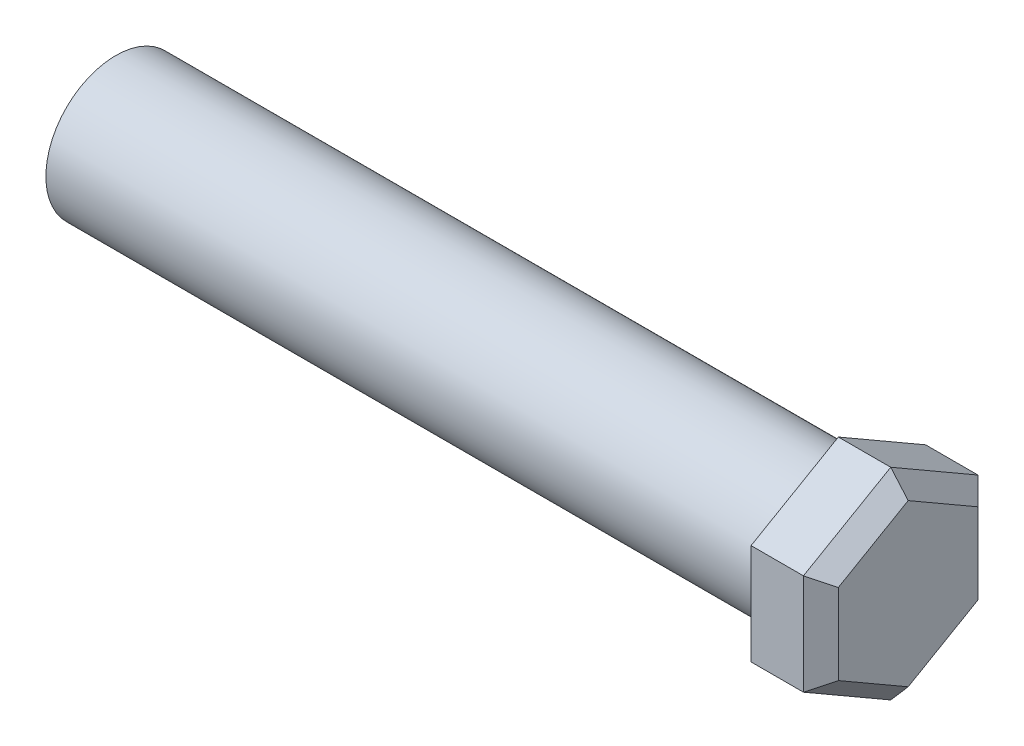
ISO-10303-21;
HEADER;
FILE_DESCRIPTION(('STEP AP214'),'2;1');
FILE_NAME('part.step','',(''),(''),'','','');
FILE_SCHEMA(('AUTOMOTIVE_DESIGN { 1 0 10303 214 1 1 1 1 }'));
ENDSEC;
DATA;
#1=APPLICATION_CONTEXT('core data for automotive mechanical design processes');
#2=APPLICATION_PROTOCOL_DEFINITION('international standard','automotive_design',2000,#1);
#3=PRODUCT_CONTEXT('',#1,'mechanical');
#4=PRODUCT('Part','Part','',(#3));
#5=PRODUCT_RELATED_PRODUCT_CATEGORY('part','',(#4));
#6=PRODUCT_DEFINITION_FORMATION('','',#4);
#7=PRODUCT_DEFINITION_CONTEXT('part definition',#1,'design');
#8=PRODUCT_DEFINITION('design','',#6,#7);
#9=PRODUCT_DEFINITION_SHAPE('','',#8);
#10=(LENGTH_UNIT() NAMED_UNIT(*) SI_UNIT(.MILLI.,.METRE.));
#11=(NAMED_UNIT(*) PLANE_ANGLE_UNIT() SI_UNIT($,.RADIAN.));
#12=(NAMED_UNIT(*) SI_UNIT($,.STERADIAN.) SOLID_ANGLE_UNIT());
#13=UNCERTAINTY_MEASURE_WITH_UNIT(LENGTH_MEASURE(1.E-05),#10,'distance_accuracy_value','');
#14=(GEOMETRIC_REPRESENTATION_CONTEXT(3) GLOBAL_UNCERTAINTY_ASSIGNED_CONTEXT((#13)) GLOBAL_UNIT_ASSIGNED_CONTEXT((#10,
#11,#12)) REPRESENTATION_CONTEXT('',''));
#15=CARTESIAN_POINT('',(0.,0.,0.));
#16=DIRECTION('',(0.,0.,1.));
#17=DIRECTION('',(1.,0.,0.));
#18=AXIS2_PLACEMENT_3D('',#15,#16,#17);
#19=CARTESIAN_POINT('',(20.7,0.,0.));
#20=DIRECTION('',(-1.,0.,0.));
#21=DIRECTION('',(0.,0.,1.));
#22=AXIS2_PLACEMENT_3D('',#19,#20,#21);
#23=CYLINDRICAL_SURFACE('',#22,2.);
#24=CARTESIAN_POINT('',(20.7,0.,0.));
#25=DIRECTION('',(1.,0.,0.));
#26=DIRECTION('',(0.,0.,-1.));
#27=AXIS2_PLACEMENT_3D('',#24,#25,#26);
#28=CIRCLE('',#27,2.);
#29=CARTESIAN_POINT('',(20.7,0.,-2.));
#30=VERTEX_POINT('',#29);
#31=EDGE_CURVE('E175',#30,#30,#28,.T.);
#32=ORIENTED_EDGE('',*,*,#31,.F.);
#33=EDGE_LOOP('',(#32));
#34=FACE_BOUND('',#33,.T.);
#35=CARTESIAN_POINT('',(0.,0.,0.));
#36=DIRECTION('',(1.,0.,0.));
#37=DIRECTION('',(0.,0.,-1.));
#38=AXIS2_PLACEMENT_3D('',#35,#36,#37);
#39=CIRCLE('',#38,2.);
#40=CARTESIAN_POINT('',(0.,0.,-2.));
#41=VERTEX_POINT('',#40);
#42=EDGE_CURVE('E126',#41,#41,#39,.T.);
#43=ORIENTED_EDGE('',*,*,#42,.T.);
#44=EDGE_LOOP('',(#43));
#45=FACE_BOUND('',#44,.T.);
#46=ADVANCED_FACE('F45',(#34,#45),#23,.T.);
#47=CARTESIAN_POINT('',(0.,0.,0.));
#48=DIRECTION('',(1.,0.,0.));
#49=DIRECTION('',(0.,0.,-1.));
#50=AXIS2_PLACEMENT_3D('',#47,#48,#49);
#51=PLANE('',#50);
#52=ORIENTED_EDGE('',*,*,#42,.F.);
#53=EDGE_LOOP('',(#52));
#54=FACE_BOUND('',#53,.T.);
#55=ADVANCED_FACE('F275',(#54),#51,.F.);
#56=CARTESIAN_POINT('',(22.7,-1.44337567297406,2.5));
#57=DIRECTION('',(0.,0.866025403784438,-0.5));
#58=DIRECTION('',(0.,0.5,0.866025403784439));
#59=AXIS2_PLACEMENT_3D('',#56,#57,#58);
#60=PLANE('',#59);
#61=DIRECTION('',(-1.,0.,0.));
#62=VECTOR('',#61,1.);
#63=CARTESIAN_POINT('',(22.7,-2.88675134594813,0.));
#64=LINE('',#63,#62);
#65=CARTESIAN_POINT('',(22.2,-2.88675134594813,0.));
#66=VERTEX_POINT('',#65);
#67=CARTESIAN_POINT('',(20.7,-2.88675134594813,0.));
#68=VERTEX_POINT('',#67);
#69=EDGE_CURVE('E117',#66,#68,#64,.T.);
#70=ORIENTED_EDGE('',*,*,#69,.F.);
#71=DIRECTION('',(0.,0.5,0.866025403784439));
#72=VECTOR('',#71,1.);
#73=CARTESIAN_POINT('',(22.2,-1.44337567297406,2.5));
#74=LINE('',#73,#72);
#75=CARTESIAN_POINT('',(22.2,-1.44337567297406,2.5));
#76=VERTEX_POINT('',#75);
#77=EDGE_CURVE('E11',#66,#76,#74,.T.);
#78=ORIENTED_EDGE('',*,*,#77,.T.);
#79=DIRECTION('',(-1.,0.,0.));
#80=VECTOR('',#79,1.);
#81=CARTESIAN_POINT('',(22.7,-1.44337567297406,2.5));
#82=LINE('',#81,#80);
#83=CARTESIAN_POINT('',(20.7,-1.44337567297406,2.5));
#84=VERTEX_POINT('',#83);
#85=EDGE_CURVE('E141',#76,#84,#82,.T.);
#86=ORIENTED_EDGE('',*,*,#85,.T.);
#87=DIRECTION('',(0.,-0.5,-0.866025403784439));
#88=VECTOR('',#87,1.);
#89=CARTESIAN_POINT('',(20.7,-1.44337567297406,2.5));
#90=LINE('',#89,#88);
#91=EDGE_CURVE('E133',#84,#68,#90,.T.);
#92=ORIENTED_EDGE('',*,*,#91,.T.);
#93=EDGE_LOOP('',(#70,#78,#86,#92));
#94=FACE_BOUND('',#93,.T.);
#95=ADVANCED_FACE('F139',(#94),#60,.F.);
#96=CARTESIAN_POINT('',(22.7,-2.88675134594813,0.));
#97=DIRECTION('',(0.,0.866025403784439,0.5));
#98=DIRECTION('',(0.,-0.5,0.866025403784439));
#99=AXIS2_PLACEMENT_3D('',#96,#97,#98);
#100=PLANE('',#99);
#101=DIRECTION('',(-1.,0.,0.));
#102=VECTOR('',#101,1.);
#103=CARTESIAN_POINT('',(22.7,-1.44337567297406,-2.5));
#104=LINE('',#103,#102);
#105=CARTESIAN_POINT('',(22.2,-1.44337567297406,-2.5));
#106=VERTEX_POINT('',#105);
#107=CARTESIAN_POINT('',(20.7,-1.44337567297406,-2.5));
#108=VERTEX_POINT('',#107);
#109=EDGE_CURVE('E127',#106,#108,#104,.T.);
#110=ORIENTED_EDGE('',*,*,#109,.F.);
#111=DIRECTION('',(0.,-0.5,0.866025403784439));
#112=VECTOR('',#111,1.);
#113=CARTESIAN_POINT('',(22.2,-2.88675134594813,0.));
#114=LINE('',#113,#112);
#115=EDGE_CURVE('E56',#106,#66,#114,.T.);
#116=ORIENTED_EDGE('',*,*,#115,.T.);
#117=ORIENTED_EDGE('',*,*,#69,.T.);
#118=DIRECTION('',(0.,0.5,-0.866025403784439));
#119=VECTOR('',#118,1.);
#120=CARTESIAN_POINT('',(20.7,-2.88675134594813,0.));
#121=LINE('',#120,#119);
#122=EDGE_CURVE('E120',#68,#108,#121,.T.);
#123=ORIENTED_EDGE('',*,*,#122,.T.);
#124=EDGE_LOOP('',(#110,#116,#117,#123));
#125=FACE_BOUND('',#124,.T.);
#126=ADVANCED_FACE('F119',(#125),#100,.F.);
#127=CARTESIAN_POINT('',(22.7,-1.44337567297406,-2.5));
#128=DIRECTION('',(0.,0.,1.));
#129=DIRECTION('',(1.,0.,0.));
#130=AXIS2_PLACEMENT_3D('',#127,#128,#129);
#131=PLANE('',#130);
#132=DIRECTION('',(-1.,0.,0.));
#133=VECTOR('',#132,1.);
#134=CARTESIAN_POINT('',(22.7,1.44337567297406,-2.5));
#135=LINE('',#134,#133);
#136=CARTESIAN_POINT('',(22.2,1.44337567297406,-2.5));
#137=VERTEX_POINT('',#136);
#138=CARTESIAN_POINT('',(20.7,1.44337567297406,-2.5));
#139=VERTEX_POINT('',#138);
#140=EDGE_CURVE('E170',#137,#139,#135,.T.);
#141=ORIENTED_EDGE('',*,*,#140,.F.);
#142=DIRECTION('',(0.,-1.,0.));
#143=VECTOR('',#142,1.);
#144=CARTESIAN_POINT('',(22.2,-1.44337567297406,-2.5));
#145=LINE('',#144,#143);
#146=EDGE_CURVE('E71',#137,#106,#145,.T.);
#147=ORIENTED_EDGE('',*,*,#146,.T.);
#148=ORIENTED_EDGE('',*,*,#109,.T.);
#149=DIRECTION('',(0.,1.,0.));
#150=VECTOR('',#149,1.);
#151=CARTESIAN_POINT('',(20.7,-1.44337567297406,-2.5));
#152=LINE('',#151,#150);
#153=EDGE_CURVE('E136',#108,#139,#152,.T.);
#154=ORIENTED_EDGE('',*,*,#153,.T.);
#155=EDGE_LOOP('',(#141,#147,#148,#154));
#156=FACE_BOUND('',#155,.T.);
#157=ADVANCED_FACE('F399',(#156),#131,.F.);
#158=CARTESIAN_POINT('',(22.7,1.44337567297406,-2.5));
#159=DIRECTION('',(0.,-0.866025403784439,0.5));
#160=DIRECTION('',(0.,-0.5,-0.866025403784439));
#161=AXIS2_PLACEMENT_3D('',#158,#159,#160);
#162=PLANE('',#161);
#163=DIRECTION('',(-1.,0.,0.));
#164=VECTOR('',#163,1.);
#165=CARTESIAN_POINT('',(22.7,2.88675134594813,0.));
#166=LINE('',#165,#164);
#167=CARTESIAN_POINT('',(22.2,2.88675134594813,0.));
#168=VERTEX_POINT('',#167);
#169=CARTESIAN_POINT('',(20.7,2.88675134594813,0.));
#170=VERTEX_POINT('',#169);
#171=EDGE_CURVE('E167',#168,#170,#166,.T.);
#172=ORIENTED_EDGE('',*,*,#171,.F.);
#173=DIRECTION('',(0.,-0.5,-0.866025403784439));
#174=VECTOR('',#173,1.);
#175=CARTESIAN_POINT('',(22.2,1.44337567297406,-2.5));
#176=LINE('',#175,#174);
#177=EDGE_CURVE('E208',#168,#137,#176,.T.);
#178=ORIENTED_EDGE('',*,*,#177,.T.);
#179=ORIENTED_EDGE('',*,*,#140,.T.);
#180=DIRECTION('',(0.,0.5,0.866025403784439));
#181=VECTOR('',#180,1.);
#182=CARTESIAN_POINT('',(20.7,1.44337567297406,-2.5));
#183=LINE('',#182,#181);
#184=EDGE_CURVE('E151',#139,#170,#183,.T.);
#185=ORIENTED_EDGE('',*,*,#184,.T.);
#186=EDGE_LOOP('',(#172,#178,#179,#185));
#187=FACE_BOUND('',#186,.T.);
#188=ADVANCED_FACE('F263',(#187),#162,.F.);
#189=CARTESIAN_POINT('',(22.7,2.88675134594813,0.));
#190=DIRECTION('',(0.,-0.866025403784439,-0.5));
#191=DIRECTION('',(0.,0.5,-0.866025403784439));
#192=AXIS2_PLACEMENT_3D('',#189,#190,#191);
#193=PLANE('',#192);
#194=DIRECTION('',(-1.,0.,0.));
#195=VECTOR('',#194,1.);
#196=CARTESIAN_POINT('',(22.7,1.44337567297406,2.5));
#197=LINE('',#196,#195);
#198=CARTESIAN_POINT('',(22.2,1.44337567297406,2.5));
#199=VERTEX_POINT('',#198);
#200=CARTESIAN_POINT('',(20.7,1.44337567297406,2.5));
#201=VERTEX_POINT('',#200);
#202=EDGE_CURVE('E164',#199,#201,#197,.T.);
#203=ORIENTED_EDGE('',*,*,#202,.F.);
#204=DIRECTION('',(0.,0.5,-0.866025403784439));
#205=VECTOR('',#204,1.);
#206=CARTESIAN_POINT('',(22.2,2.88675134594813,0.));
#207=LINE('',#206,#205);
#208=EDGE_CURVE('E205',#199,#168,#207,.T.);
#209=ORIENTED_EDGE('',*,*,#208,.T.);
#210=ORIENTED_EDGE('',*,*,#171,.T.);
#211=DIRECTION('',(0.,-0.5,0.866025403784439));
#212=VECTOR('',#211,1.);
#213=CARTESIAN_POINT('',(20.7,2.88675134594813,0.));
#214=LINE('',#213,#212);
#215=EDGE_CURVE('E155',#170,#201,#214,.T.);
#216=ORIENTED_EDGE('',*,*,#215,.T.);
#217=EDGE_LOOP('',(#203,#209,#210,#216));
#218=FACE_BOUND('',#217,.T.);
#219=ADVANCED_FACE('F260',(#218),#193,.F.);
#220=CARTESIAN_POINT('',(22.7,1.44337567297406,2.5));
#221=DIRECTION('',(0.,0.,-1.));
#222=DIRECTION('',(-1.,0.,0.));
#223=AXIS2_PLACEMENT_3D('',#220,#221,#222);
#224=PLANE('',#223);
#225=ORIENTED_EDGE('',*,*,#85,.F.);
#226=DIRECTION('',(0.,1.,0.));
#227=VECTOR('',#226,1.);
#228=CARTESIAN_POINT('',(22.2,1.44337567297406,2.5));
#229=LINE('',#228,#227);
#230=EDGE_CURVE('E201',#76,#199,#229,.T.);
#231=ORIENTED_EDGE('',*,*,#230,.T.);
#232=ORIENTED_EDGE('',*,*,#202,.T.);
#233=DIRECTION('',(0.,-1.,0.));
#234=VECTOR('',#233,1.);
#235=CARTESIAN_POINT('',(20.7,1.44337567297406,2.5));
#236=LINE('',#235,#234);
#237=EDGE_CURVE('E159',#201,#84,#236,.T.);
#238=ORIENTED_EDGE('',*,*,#237,.T.);
#239=EDGE_LOOP('',(#225,#231,#232,#238));
#240=FACE_BOUND('',#239,.T.);
#241=ADVANCED_FACE('F249',(#240),#224,.F.);
#242=CARTESIAN_POINT('',(22.7,0.,0.));
#243=DIRECTION('',(1.,0.,0.));
#244=DIRECTION('',(0.,0.,-1.));
#245=AXIS2_PLACEMENT_3D('',#242,#243,#244);
#246=PLANE('',#245);
#247=DIRECTION('',(0.,-0.5,0.866025403784439));
#248=VECTOR('',#247,1.);
#249=CARTESIAN_POINT('',(22.7,1.01036297108185,2.25));
#250=LINE('',#249,#248);
#251=CARTESIAN_POINT('',(22.7,2.3094010767585,0.));
#252=VERTEX_POINT('',#251);
#253=CARTESIAN_POINT('',(22.7,1.15470053837925,2.));
#254=VERTEX_POINT('',#253);
#255=EDGE_CURVE('E194',#252,#254,#250,.T.);
#256=ORIENTED_EDGE('',*,*,#255,.T.);
#257=DIRECTION('',(0.,-1.,0.));
#258=VECTOR('',#257,1.);
#259=CARTESIAN_POINT('',(22.7,-1.44337567297406,2.));
#260=LINE('',#259,#258);
#261=CARTESIAN_POINT('',(22.7,-1.15470053837925,2.));
#262=VERTEX_POINT('',#261);
#263=EDGE_CURVE('E197',#254,#262,#260,.T.);
#264=ORIENTED_EDGE('',*,*,#263,.T.);
#265=DIRECTION('',(0.,-0.5,-0.866025403784439));
#266=VECTOR('',#265,1.);
#267=CARTESIAN_POINT('',(22.7,-2.45373864405591,-0.25));
#268=LINE('',#267,#266);
#269=CARTESIAN_POINT('',(22.7,-2.3094010767585,0.));
#270=VERTEX_POINT('',#269);
#271=EDGE_CURVE('E179',#262,#270,#268,.T.);
#272=ORIENTED_EDGE('',*,*,#271,.T.);
#273=DIRECTION('',(0.,0.5,-0.866025403784439));
#274=VECTOR('',#273,1.);
#275=CARTESIAN_POINT('',(22.7,-1.01036297108185,-2.25));
#276=LINE('',#275,#274);
#277=CARTESIAN_POINT('',(22.7,-1.15470053837925,-2.));
#278=VERTEX_POINT('',#277);
#279=EDGE_CURVE('E185',#270,#278,#276,.T.);
#280=ORIENTED_EDGE('',*,*,#279,.T.);
#281=DIRECTION('',(0.,1.,0.));
#282=VECTOR('',#281,1.);
#283=CARTESIAN_POINT('',(22.7,1.44337567297406,-2.));
#284=LINE('',#283,#282);
#285=CARTESIAN_POINT('',(22.7,1.15470053837925,-2.));
#286=VERTEX_POINT('',#285);
#287=EDGE_CURVE('E188',#278,#286,#284,.T.);
#288=ORIENTED_EDGE('',*,*,#287,.T.);
#289=DIRECTION('',(0.,0.5,0.866025403784439));
#290=VECTOR('',#289,1.);
#291=CARTESIAN_POINT('',(22.7,2.45373864405591,0.249999999999999));
#292=LINE('',#291,#290);
#293=EDGE_CURVE('E191',#286,#252,#292,.T.);
#294=ORIENTED_EDGE('',*,*,#293,.T.);
#295=EDGE_LOOP('',(#256,#264,#272,#280,#288,#294));
#296=FACE_BOUND('',#295,.T.);
#297=ADVANCED_FACE('F239',(#296),#246,.T.);
#298=CARTESIAN_POINT('',(20.7,0.,0.));
#299=DIRECTION('',(1.,0.,0.));
#300=DIRECTION('',(0.,0.,-1.));
#301=AXIS2_PLACEMENT_3D('',#298,#299,#300);
#302=PLANE('',#301);
#303=ORIENTED_EDGE('',*,*,#31,.T.);
#304=EDGE_LOOP('',(#303));
#305=FACE_BOUND('',#304,.T.);
#306=ORIENTED_EDGE('',*,*,#91,.F.);
#307=ORIENTED_EDGE('',*,*,#237,.F.);
#308=ORIENTED_EDGE('',*,*,#215,.F.);
#309=ORIENTED_EDGE('',*,*,#184,.F.);
#310=ORIENTED_EDGE('',*,*,#153,.F.);
#311=ORIENTED_EDGE('',*,*,#122,.F.);
#312=EDGE_LOOP('',(#306,#307,#308,#309,#310,#311));
#313=FACE_BOUND('',#312,.T.);
#314=ADVANCED_FACE('F131',(#305,#313),#302,.F.);
#315=CARTESIAN_POINT('',(22.7,0.,-2.));
#316=DIRECTION('',(0.707106781186547,0.,-0.707106781186548));
#317=DIRECTION('',(0.,-1.,0.));
#318=AXIS2_PLACEMENT_3D('',#315,#316,#317);
#319=PLANE('',#318);
#320=DIRECTION('',(0.654653670707978,0.377964473009226,0.654653670707976));
#321=VECTOR('',#320,1.);
#322=CARTESIAN_POINT('',(22.9857142857143,-0.989743318610788,-1.71428571428572));
#323=LINE('',#322,#321);
#324=EDGE_CURVE('E147',#106,#278,#323,.T.);
#325=ORIENTED_EDGE('',*,*,#324,.F.);
#326=ORIENTED_EDGE('',*,*,#146,.F.);
#327=DIRECTION('',(0.654653670707978,-0.377964473009226,0.654653670707976));
#328=VECTOR('',#327,1.);
#329=CARTESIAN_POINT('',(22.9857142857143,0.989743318610789,-1.71428571428572));
#330=LINE('',#329,#328);
#331=EDGE_CURVE('E50',#286,#137,#330,.F.);
#332=ORIENTED_EDGE('',*,*,#331,.F.);
#333=ORIENTED_EDGE('',*,*,#287,.F.);
#334=EDGE_LOOP('',(#325,#326,#332,#333));
#335=FACE_BOUND('',#334,.T.);
#336=ADVANCED_FACE('F48',(#335),#319,.T.);
#337=CARTESIAN_POINT('',(22.7,1.73205080756888,-1.));
#338=DIRECTION('',(0.707106781186546,0.612372435695795,-0.353553390593274));
#339=DIRECTION('',(0.,-0.5,-0.866025403784439));
#340=AXIS2_PLACEMENT_3D('',#337,#338,#339);
#341=PLANE('',#340);
#342=ORIENTED_EDGE('',*,*,#331,.T.);
#343=ORIENTED_EDGE('',*,*,#177,.F.);
#344=DIRECTION('',(0.654653670707978,-0.755928946018454,0.));
#345=VECTOR('',#344,1.);
#346=CARTESIAN_POINT('',(22.9857142857143,1.97948663722158,0.));
#347=LINE('',#346,#345);
#348=EDGE_CURVE('E225',#252,#168,#347,.F.);
#349=ORIENTED_EDGE('',*,*,#348,.F.);
#350=ORIENTED_EDGE('',*,*,#293,.F.);
#351=EDGE_LOOP('',(#342,#343,#349,#350));
#352=FACE_BOUND('',#351,.T.);
#353=ADVANCED_FACE('F266',(#352),#341,.T.);
#354=CARTESIAN_POINT('',(22.7,-1.73205080756888,-1.));
#355=DIRECTION('',(0.707106781186546,-0.612372435695795,-0.353553390593274));
#356=DIRECTION('',(0.,-0.5,0.866025403784439));
#357=AXIS2_PLACEMENT_3D('',#354,#355,#356);
#358=PLANE('',#357);
#359=ORIENTED_EDGE('',*,*,#324,.T.);
#360=ORIENTED_EDGE('',*,*,#279,.F.);
#361=DIRECTION('',(0.654653670707978,0.755928946018454,0.));
#362=VECTOR('',#361,1.);
#363=CARTESIAN_POINT('',(22.9857142857143,-1.97948663722158,0.));
#364=LINE('',#363,#362);
#365=EDGE_CURVE('E221',#66,#270,#364,.T.);
#366=ORIENTED_EDGE('',*,*,#365,.F.);
#367=ORIENTED_EDGE('',*,*,#115,.F.);
#368=EDGE_LOOP('',(#359,#360,#366,#367));
#369=FACE_BOUND('',#368,.T.);
#370=ADVANCED_FACE('F233',(#369),#358,.T.);
#371=CARTESIAN_POINT('',(22.7,1.73205080756888,1.));
#372=DIRECTION('',(0.707106781186547,0.612372435695795,0.353553390593274));
#373=DIRECTION('',(0.,0.5,-0.866025403784439));
#374=AXIS2_PLACEMENT_3D('',#371,#372,#373);
#375=PLANE('',#374);
#376=ORIENTED_EDGE('',*,*,#348,.T.);
#377=ORIENTED_EDGE('',*,*,#208,.F.);
#378=DIRECTION('',(0.654653670707978,-0.377964473009227,-0.654653670707976));
#379=VECTOR('',#378,1.);
#380=CARTESIAN_POINT('',(22.9857142857143,0.989743318610787,1.71428571428572));
#381=LINE('',#380,#379);
#382=EDGE_CURVE('E218',#254,#199,#381,.F.);
#383=ORIENTED_EDGE('',*,*,#382,.F.);
#384=ORIENTED_EDGE('',*,*,#255,.F.);
#385=EDGE_LOOP('',(#376,#377,#383,#384));
#386=FACE_BOUND('',#385,.T.);
#387=ADVANCED_FACE('F257',(#386),#375,.T.);
#388=CARTESIAN_POINT('',(22.7,-1.73205080756888,1.));
#389=DIRECTION('',(0.707106781186546,-0.612372435695796,0.353553390593275));
#390=DIRECTION('',(0.,0.5,0.866025403784439));
#391=AXIS2_PLACEMENT_3D('',#388,#389,#390);
#392=PLANE('',#391);
#393=ORIENTED_EDGE('',*,*,#365,.T.);
#394=ORIENTED_EDGE('',*,*,#271,.F.);
#395=DIRECTION('',(-0.654653670707979,-0.377964473009227,0.654653670707976));
#396=VECTOR('',#395,1.);
#397=CARTESIAN_POINT('',(22.9857142857143,-0.989743318610788,1.71428571428572));
#398=LINE('',#397,#396);
#399=EDGE_CURVE('E215',#76,#262,#398,.F.);
#400=ORIENTED_EDGE('',*,*,#399,.F.);
#401=ORIENTED_EDGE('',*,*,#77,.F.);
#402=EDGE_LOOP('',(#393,#394,#400,#401));
#403=FACE_BOUND('',#402,.T.);
#404=ADVANCED_FACE('F245',(#403),#392,.T.);
#405=CARTESIAN_POINT('',(22.7,0.,2.));
#406=DIRECTION('',(0.707106781186546,0.,0.707106781186549));
#407=DIRECTION('',(0.,1.,0.));
#408=AXIS2_PLACEMENT_3D('',#405,#406,#407);
#409=PLANE('',#408);
#410=ORIENTED_EDGE('',*,*,#382,.T.);
#411=ORIENTED_EDGE('',*,*,#230,.F.);
#412=ORIENTED_EDGE('',*,*,#399,.T.);
#413=ORIENTED_EDGE('',*,*,#263,.F.);
#414=EDGE_LOOP('',(#410,#411,#412,#413));
#415=FACE_BOUND('',#414,.T.);
#416=ADVANCED_FACE('F252',(#415),#409,.T.);
#417=CLOSED_SHELL('',(#46,#55,#95,#126,#157,#188,#219,#241,#297,#314,#336,#353,#370,#387,#404,#416));
#418=MANIFOLD_SOLID_BREP('B2',#417);
#419=ADVANCED_BREP_SHAPE_REPRESENTATION('',(#18,#418),#14);
#420=SHAPE_DEFINITION_REPRESENTATION(#9,#419);
ENDSEC;
END-ISO-10303-21;
